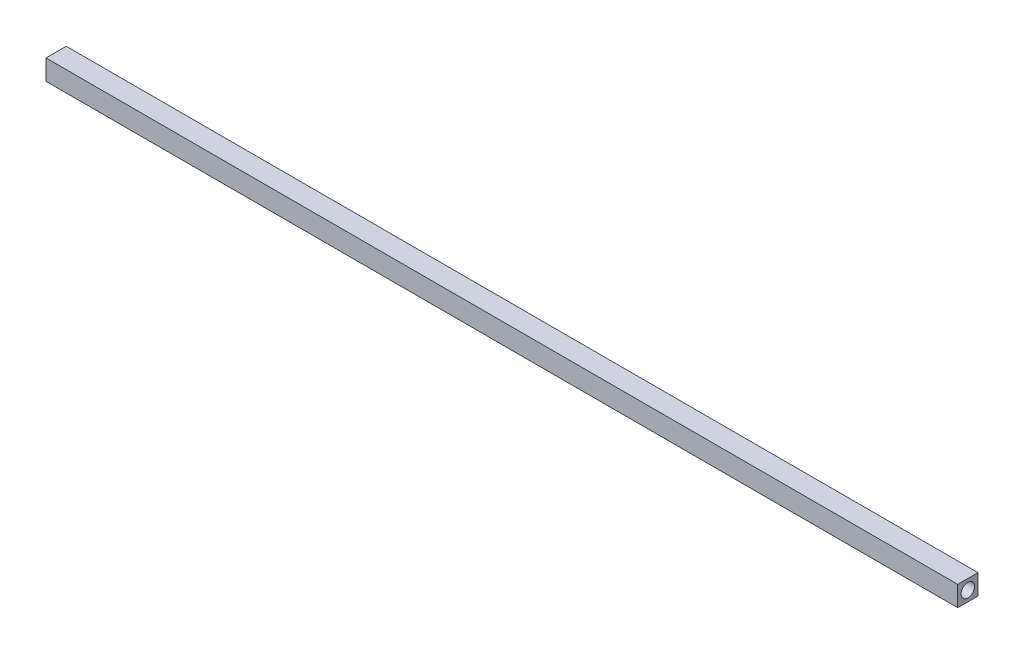
ISO-10303-21;
HEADER;
FILE_DESCRIPTION(('STEP AP214'),'2;1');
FILE_NAME('part.step','',(''),(''),'','','');
FILE_SCHEMA(('AUTOMOTIVE_DESIGN { 1 0 10303 214 1 1 1 1 }'));
ENDSEC;
DATA;
#1=APPLICATION_CONTEXT('core data for automotive mechanical design processes');
#2=APPLICATION_PROTOCOL_DEFINITION('international standard','automotive_design',2000,#1);
#3=PRODUCT_CONTEXT('',#1,'mechanical');
#4=PRODUCT('Part','Part','',(#3));
#5=PRODUCT_RELATED_PRODUCT_CATEGORY('part','',(#4));
#6=PRODUCT_DEFINITION_FORMATION('','',#4);
#7=PRODUCT_DEFINITION_CONTEXT('part definition',#1,'design');
#8=PRODUCT_DEFINITION('design','',#6,#7);
#9=PRODUCT_DEFINITION_SHAPE('','',#8);
#10=(LENGTH_UNIT() NAMED_UNIT(*) SI_UNIT(.MILLI.,.METRE.));
#11=(NAMED_UNIT(*) PLANE_ANGLE_UNIT() SI_UNIT($,.RADIAN.));
#12=(NAMED_UNIT(*) SI_UNIT($,.STERADIAN.) SOLID_ANGLE_UNIT());
#13=UNCERTAINTY_MEASURE_WITH_UNIT(LENGTH_MEASURE(1.E-05),#10,'distance_accuracy_value','');
#14=(GEOMETRIC_REPRESENTATION_CONTEXT(3) GLOBAL_UNCERTAINTY_ASSIGNED_CONTEXT((#13)) GLOBAL_UNIT_ASSIGNED_CONTEXT((#10,
#11,#12)) REPRESENTATION_CONTEXT('',''));
#15=CARTESIAN_POINT('',(0.,0.,0.));
#16=DIRECTION('',(0.,0.,1.));
#17=DIRECTION('',(1.,0.,0.));
#18=AXIS2_PLACEMENT_3D('',#15,#16,#17);
#19=CARTESIAN_POINT('',(135.,0.,0.));
#20=DIRECTION('',(1.,0.,0.));
#21=DIRECTION('',(0.,0.,-1.));
#22=AXIS2_PLACEMENT_3D('',#19,#20,#21);
#23=PLANE('',#22);
#24=DIRECTION('',(0.,1.,0.));
#25=VECTOR('',#24,1.);
#26=CARTESIAN_POINT('',(135.,1.5,-1.5));
#27=LINE('',#26,#25);
#28=CARTESIAN_POINT('',(135.,-1.5,-1.5));
#29=VERTEX_POINT('',#28);
#30=CARTESIAN_POINT('',(135.,1.5,-1.5));
#31=VERTEX_POINT('',#30);
#32=EDGE_CURVE('E90',#29,#31,#27,.T.);
#33=ORIENTED_EDGE('',*,*,#32,.T.);
#34=DIRECTION('',(0.,0.,1.));
#35=VECTOR('',#34,1.);
#36=CARTESIAN_POINT('',(135.,1.5,1.5));
#37=LINE('',#36,#35);
#38=CARTESIAN_POINT('',(135.,1.5,1.5));
#39=VERTEX_POINT('',#38);
#40=EDGE_CURVE('E85',#31,#39,#37,.T.);
#41=ORIENTED_EDGE('',*,*,#40,.T.);
#42=DIRECTION('',(0.,-1.,0.));
#43=VECTOR('',#42,1.);
#44=CARTESIAN_POINT('',(135.,1.5,1.5));
#45=LINE('',#44,#43);
#46=CARTESIAN_POINT('',(135.,-1.5,1.5));
#47=VERTEX_POINT('',#46);
#48=EDGE_CURVE('E88',#39,#47,#45,.T.);
#49=ORIENTED_EDGE('',*,*,#48,.T.);
#50=DIRECTION('',(0.,0.,-1.));
#51=VECTOR('',#50,1.);
#52=CARTESIAN_POINT('',(135.,-1.5,1.5));
#53=LINE('',#52,#51);
#54=EDGE_CURVE('E55',#47,#29,#53,.T.);
#55=ORIENTED_EDGE('',*,*,#54,.T.);
#56=EDGE_LOOP('',(#33,#41,#49,#55));
#57=FACE_BOUND('',#56,.T.);
#58=CARTESIAN_POINT('',(135.,0.,0.));
#59=DIRECTION('',(1.,0.,0.));
#60=DIRECTION('',(0.,0.,-1.));
#61=AXIS2_PLACEMENT_3D('',#58,#59,#60);
#62=CIRCLE('',#61,1.);
#63=CARTESIAN_POINT('',(135.,0.,-1.));
#64=VERTEX_POINT('',#63);
#65=EDGE_CURVE('E105',#64,#64,#62,.T.);
#66=ORIENTED_EDGE('',*,*,#65,.F.);
#67=EDGE_LOOP('',(#66));
#68=FACE_BOUND('',#67,.T.);
#69=ADVANCED_FACE('F38',(#57,#68),#23,.T.);
#70=CARTESIAN_POINT('',(0.,0.,0.));
#71=DIRECTION('',(1.,0.,0.));
#72=DIRECTION('',(0.,0.,-1.));
#73=AXIS2_PLACEMENT_3D('',#70,#71,#72);
#74=PLANE('',#73);
#75=DIRECTION('',(0.,1.,0.));
#76=VECTOR('',#75,1.);
#77=CARTESIAN_POINT('',(0.,1.5,-1.5));
#78=LINE('',#77,#76);
#79=CARTESIAN_POINT('',(0.,-1.5,-1.5));
#80=VERTEX_POINT('',#79);
#81=CARTESIAN_POINT('',(0.,1.5,-1.5));
#82=VERTEX_POINT('',#81);
#83=EDGE_CURVE('E102',#80,#82,#78,.T.);
#84=ORIENTED_EDGE('',*,*,#83,.F.);
#85=DIRECTION('',(0.,0.,-1.));
#86=VECTOR('',#85,1.);
#87=CARTESIAN_POINT('',(0.,-1.5,1.5));
#88=LINE('',#87,#86);
#89=CARTESIAN_POINT('',(0.,-1.5,1.5));
#90=VERTEX_POINT('',#89);
#91=EDGE_CURVE('E78',#90,#80,#88,.T.);
#92=ORIENTED_EDGE('',*,*,#91,.F.);
#93=DIRECTION('',(0.,-1.,0.));
#94=VECTOR('',#93,1.);
#95=CARTESIAN_POINT('',(0.,1.5,1.5));
#96=LINE('',#95,#94);
#97=CARTESIAN_POINT('',(0.,1.5,1.5));
#98=VERTEX_POINT('',#97);
#99=EDGE_CURVE('E72',#98,#90,#96,.T.);
#100=ORIENTED_EDGE('',*,*,#99,.F.);
#101=DIRECTION('',(0.,0.,1.));
#102=VECTOR('',#101,1.);
#103=CARTESIAN_POINT('',(0.,1.5,1.5));
#104=LINE('',#103,#102);
#105=EDGE_CURVE('E94',#82,#98,#104,.T.);
#106=ORIENTED_EDGE('',*,*,#105,.F.);
#107=EDGE_LOOP('',(#84,#92,#100,#106));
#108=FACE_BOUND('',#107,.T.);
#109=CARTESIAN_POINT('',(0.,0.,0.));
#110=DIRECTION('',(1.,0.,0.));
#111=DIRECTION('',(0.,0.,-1.));
#112=AXIS2_PLACEMENT_3D('',#109,#110,#111);
#113=CIRCLE('',#112,1.);
#114=CARTESIAN_POINT('',(0.,0.,-1.));
#115=VERTEX_POINT('',#114);
#116=EDGE_CURVE('E117',#115,#115,#113,.T.);
#117=ORIENTED_EDGE('',*,*,#116,.T.);
#118=EDGE_LOOP('',(#117));
#119=FACE_BOUND('',#118,.T.);
#120=ADVANCED_FACE('F113',(#108,#119),#74,.F.);
#121=CARTESIAN_POINT('',(135.,1.5,-1.5));
#122=DIRECTION('',(0.,0.,1.));
#123=DIRECTION('',(0.,-1.,0.));
#124=AXIS2_PLACEMENT_3D('',#121,#122,#123);
#125=PLANE('',#124);
#126=ORIENTED_EDGE('',*,*,#83,.T.);
#127=DIRECTION('',(-1.,0.,0.));
#128=VECTOR('',#127,1.);
#129=CARTESIAN_POINT('',(135.,1.5,-1.5));
#130=LINE('',#129,#128);
#131=EDGE_CURVE('E11',#31,#82,#130,.T.);
#132=ORIENTED_EDGE('',*,*,#131,.F.);
#133=ORIENTED_EDGE('',*,*,#32,.F.);
#134=DIRECTION('',(-1.,0.,0.));
#135=VECTOR('',#134,1.);
#136=CARTESIAN_POINT('',(135.,-1.5,-1.5));
#137=LINE('',#136,#135);
#138=EDGE_CURVE('E98',#29,#80,#137,.T.);
#139=ORIENTED_EDGE('',*,*,#138,.T.);
#140=EDGE_LOOP('',(#126,#132,#133,#139));
#141=FACE_BOUND('',#140,.T.);
#142=ADVANCED_FACE('F40',(#141),#125,.F.);
#143=CARTESIAN_POINT('',(135.,1.5,1.5));
#144=DIRECTION('',(0.,-1.,0.));
#145=DIRECTION('',(0.,0.,-1.));
#146=AXIS2_PLACEMENT_3D('',#143,#144,#145);
#147=PLANE('',#146);
#148=ORIENTED_EDGE('',*,*,#105,.T.);
#149=DIRECTION('',(-1.,0.,0.));
#150=VECTOR('',#149,1.);
#151=CARTESIAN_POINT('',(135.,1.5,1.5));
#152=LINE('',#151,#150);
#153=EDGE_CURVE('E47',#39,#98,#152,.T.);
#154=ORIENTED_EDGE('',*,*,#153,.F.);
#155=ORIENTED_EDGE('',*,*,#40,.F.);
#156=ORIENTED_EDGE('',*,*,#131,.T.);
#157=EDGE_LOOP('',(#148,#154,#155,#156));
#158=FACE_BOUND('',#157,.T.);
#159=ADVANCED_FACE('F93',(#158),#147,.F.);
#160=CARTESIAN_POINT('',(135.,1.5,1.5));
#161=DIRECTION('',(0.,0.,-1.));
#162=DIRECTION('',(0.,1.,0.));
#163=AXIS2_PLACEMENT_3D('',#160,#161,#162);
#164=PLANE('',#163);
#165=ORIENTED_EDGE('',*,*,#99,.T.);
#166=DIRECTION('',(-1.,0.,0.));
#167=VECTOR('',#166,1.);
#168=CARTESIAN_POINT('',(135.,-1.5,1.5));
#169=LINE('',#168,#167);
#170=EDGE_CURVE('E95',#47,#90,#169,.T.);
#171=ORIENTED_EDGE('',*,*,#170,.F.);
#172=ORIENTED_EDGE('',*,*,#48,.F.);
#173=ORIENTED_EDGE('',*,*,#153,.T.);
#174=EDGE_LOOP('',(#165,#171,#172,#173));
#175=FACE_BOUND('',#174,.T.);
#176=ADVANCED_FACE('F96',(#175),#164,.F.);
#177=CARTESIAN_POINT('',(135.,-1.5,1.5));
#178=DIRECTION('',(0.,1.,0.));
#179=DIRECTION('',(0.,0.,1.));
#180=AXIS2_PLACEMENT_3D('',#177,#178,#179);
#181=PLANE('',#180);
#182=ORIENTED_EDGE('',*,*,#91,.T.);
#183=ORIENTED_EDGE('',*,*,#138,.F.);
#184=ORIENTED_EDGE('',*,*,#54,.F.);
#185=ORIENTED_EDGE('',*,*,#170,.T.);
#186=EDGE_LOOP('',(#182,#183,#184,#185));
#187=FACE_BOUND('',#186,.T.);
#188=ADVANCED_FACE('F110',(#187),#181,.F.);
#189=CARTESIAN_POINT('',(135.,0.,0.));
#190=DIRECTION('',(-1.,0.,0.));
#191=DIRECTION('',(0.,0.,1.));
#192=AXIS2_PLACEMENT_3D('',#189,#190,#191);
#193=CYLINDRICAL_SURFACE('',#192,1.);
#194=ORIENTED_EDGE('',*,*,#65,.T.);
#195=EDGE_LOOP('',(#194));
#196=FACE_BOUND('',#195,.T.);
#197=ORIENTED_EDGE('',*,*,#116,.F.);
#198=EDGE_LOOP('',(#197));
#199=FACE_BOUND('',#198,.T.);
#200=ADVANCED_FACE('F123',(#196,#199),#193,.F.);
#201=CLOSED_SHELL('',(#69,#120,#142,#159,#176,#188,#200));
#202=MANIFOLD_SOLID_BREP('B2',#201);
#203=ADVANCED_BREP_SHAPE_REPRESENTATION('',(#18,#202),#14);
#204=SHAPE_DEFINITION_REPRESENTATION(#9,#203);
ENDSEC;
END-ISO-10303-21;
